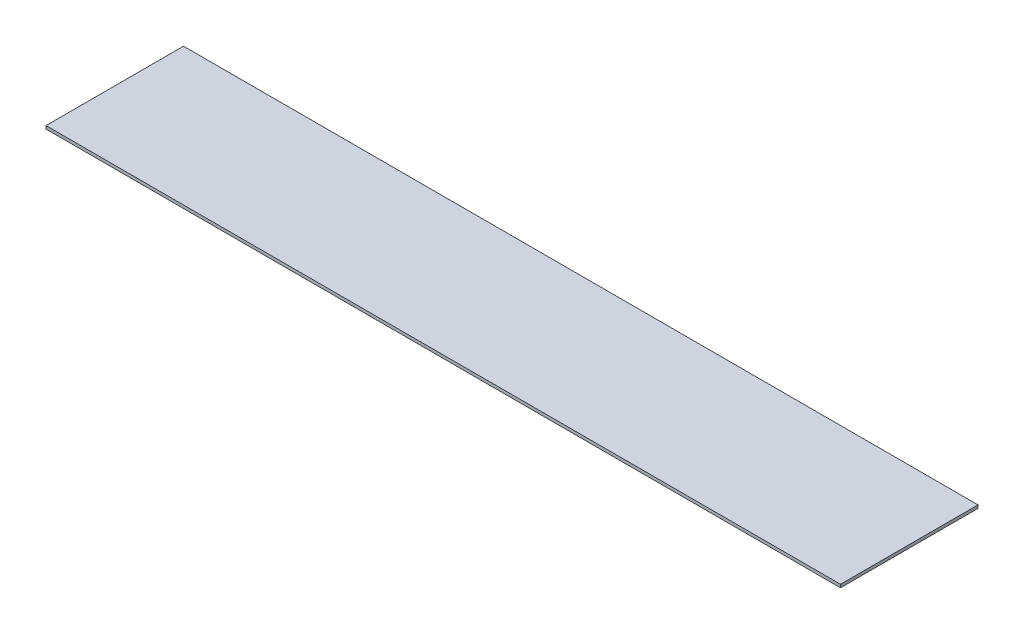
ISO-10303-21;
HEADER;
FILE_DESCRIPTION(('STEP AP214'),'2;1');
FILE_NAME('part.step','',(''),(''),'','','');
FILE_SCHEMA(('AUTOMOTIVE_DESIGN { 1 0 10303 214 1 1 1 1 }'));
ENDSEC;
DATA;
#1=APPLICATION_CONTEXT('core data for automotive mechanical design processes');
#2=APPLICATION_PROTOCOL_DEFINITION('international standard','automotive_design',2000,#1);
#3=PRODUCT_CONTEXT('',#1,'mechanical');
#4=PRODUCT('Part','Part','',(#3));
#5=PRODUCT_RELATED_PRODUCT_CATEGORY('part','',(#4));
#6=PRODUCT_DEFINITION_FORMATION('','',#4);
#7=PRODUCT_DEFINITION_CONTEXT('part definition',#1,'design');
#8=PRODUCT_DEFINITION('design','',#6,#7);
#9=PRODUCT_DEFINITION_SHAPE('','',#8);
#10=(LENGTH_UNIT() NAMED_UNIT(*) SI_UNIT(.MILLI.,.METRE.));
#11=(NAMED_UNIT(*) PLANE_ANGLE_UNIT() SI_UNIT($,.RADIAN.));
#12=(NAMED_UNIT(*) SI_UNIT($,.STERADIAN.) SOLID_ANGLE_UNIT());
#13=UNCERTAINTY_MEASURE_WITH_UNIT(LENGTH_MEASURE(1.E-05),#10,'distance_accuracy_value','');
#14=(GEOMETRIC_REPRESENTATION_CONTEXT(3) GLOBAL_UNCERTAINTY_ASSIGNED_CONTEXT((#13)) GLOBAL_UNIT_ASSIGNED_CONTEXT((#10,
#11,#12)) REPRESENTATION_CONTEXT('',''));
#15=CARTESIAN_POINT('',(0.,0.,0.));
#16=DIRECTION('',(0.,0.,1.));
#17=DIRECTION('',(1.,0.,0.));
#18=AXIS2_PLACEMENT_3D('',#15,#16,#17);
#19=CARTESIAN_POINT('',(-151.496062992126,1.,-99.7007874015748));
#20=DIRECTION('',(1.,0.,0.));
#21=DIRECTION('',(0.,0.,-1.));
#22=AXIS2_PLACEMENT_3D('',#19,#20,#21);
#23=PLANE('',#22);
#24=DIRECTION('',(0.,0.,1.));
#25=VECTOR('',#24,1.);
#26=CARTESIAN_POINT('',(-151.496062992126,0.,-99.7007874015748));
#27=LINE('',#26,#25);
#28=CARTESIAN_POINT('',(-151.496062992126,0.,-99.7007874015748));
#29=VERTEX_POINT('',#28);
#30=CARTESIAN_POINT('',(-151.496062992126,0.,-54.7007874015748));
#31=VERTEX_POINT('',#30);
#32=EDGE_CURVE('E97',#29,#31,#27,.T.);
#33=ORIENTED_EDGE('',*,*,#32,.T.);
#34=DIRECTION('',(0.,-1.,0.));
#35=VECTOR('',#34,1.);
#36=CARTESIAN_POINT('',(-151.496062992126,1.,-54.7007874015748));
#37=LINE('',#36,#35);
#38=CARTESIAN_POINT('',(-151.496062992126,1.,-54.7007874015748));
#39=VERTEX_POINT('',#38);
#40=EDGE_CURVE('E11',#39,#31,#37,.T.);
#41=ORIENTED_EDGE('',*,*,#40,.F.);
#42=DIRECTION('',(0.,0.,1.));
#43=VECTOR('',#42,1.);
#44=CARTESIAN_POINT('',(-151.496062992126,1.,-99.7007874015748));
#45=LINE('',#44,#43);
#46=CARTESIAN_POINT('',(-151.496062992126,1.,-99.7007874015748));
#47=VERTEX_POINT('',#46);
#48=EDGE_CURVE('E85',#47,#39,#45,.T.);
#49=ORIENTED_EDGE('',*,*,#48,.F.);
#50=DIRECTION('',(0.,-1.,0.));
#51=VECTOR('',#50,1.);
#52=CARTESIAN_POINT('',(-151.496062992126,1.,-99.7007874015748));
#53=LINE('',#52,#51);
#54=EDGE_CURVE('E93',#47,#29,#53,.T.);
#55=ORIENTED_EDGE('',*,*,#54,.T.);
#56=EDGE_LOOP('',(#33,#41,#49,#55));
#57=FACE_BOUND('',#56,.T.);
#58=ADVANCED_FACE('F34',(#57),#23,.F.);
#59=CARTESIAN_POINT('',(-151.496062992126,1.,-54.7007874015748));
#60=DIRECTION('',(0.,0.,-1.));
#61=DIRECTION('',(-1.,0.,0.));
#62=AXIS2_PLACEMENT_3D('',#59,#60,#61);
#63=PLANE('',#62);
#64=DIRECTION('',(1.,0.,0.));
#65=VECTOR('',#64,1.);
#66=CARTESIAN_POINT('',(-151.496062992126,0.,-54.7007874015748));
#67=LINE('',#66,#65);
#68=CARTESIAN_POINT('',(108.503937007874,0.,-54.7007874015748));
#69=VERTEX_POINT('',#68);
#70=EDGE_CURVE('E89',#31,#69,#67,.T.);
#71=ORIENTED_EDGE('',*,*,#70,.T.);
#72=DIRECTION('',(0.,-1.,0.));
#73=VECTOR('',#72,1.);
#74=CARTESIAN_POINT('',(108.503937007874,1.,-54.7007874015748));
#75=LINE('',#74,#73);
#76=CARTESIAN_POINT('',(108.503937007874,1.,-54.7007874015748));
#77=VERTEX_POINT('',#76);
#78=EDGE_CURVE('E42',#77,#69,#75,.T.);
#79=ORIENTED_EDGE('',*,*,#78,.F.);
#80=DIRECTION('',(1.,0.,0.));
#81=VECTOR('',#80,1.);
#82=CARTESIAN_POINT('',(-151.496062992126,1.,-54.7007874015748));
#83=LINE('',#82,#81);
#84=EDGE_CURVE('E80',#39,#77,#83,.T.);
#85=ORIENTED_EDGE('',*,*,#84,.F.);
#86=ORIENTED_EDGE('',*,*,#40,.T.);
#87=EDGE_LOOP('',(#71,#79,#85,#86));
#88=FACE_BOUND('',#87,.T.);
#89=ADVANCED_FACE('F88',(#88),#63,.F.);
#90=CARTESIAN_POINT('',(108.503937007874,1.,-99.7007874015748));
#91=DIRECTION('',(-1.,0.,0.));
#92=DIRECTION('',(0.,0.,1.));
#93=AXIS2_PLACEMENT_3D('',#90,#91,#92);
#94=PLANE('',#93);
#95=DIRECTION('',(0.,0.,-1.));
#96=VECTOR('',#95,1.);
#97=CARTESIAN_POINT('',(108.503937007874,0.,-99.7007874015748));
#98=LINE('',#97,#96);
#99=CARTESIAN_POINT('',(108.503937007874,0.,-99.7007874015748));
#100=VERTEX_POINT('',#99);
#101=EDGE_CURVE('E67',#69,#100,#98,.T.);
#102=ORIENTED_EDGE('',*,*,#101,.T.);
#103=DIRECTION('',(0.,-1.,0.));
#104=VECTOR('',#103,1.);
#105=CARTESIAN_POINT('',(108.503937007874,1.,-99.7007874015748));
#106=LINE('',#105,#104);
#107=CARTESIAN_POINT('',(108.503937007874,1.,-99.7007874015748));
#108=VERTEX_POINT('',#107);
#109=EDGE_CURVE('E90',#108,#100,#106,.T.);
#110=ORIENTED_EDGE('',*,*,#109,.F.);
#111=DIRECTION('',(0.,0.,-1.));
#112=VECTOR('',#111,1.);
#113=CARTESIAN_POINT('',(108.503937007874,1.,-99.7007874015748));
#114=LINE('',#113,#112);
#115=EDGE_CURVE('E83',#77,#108,#114,.T.);
#116=ORIENTED_EDGE('',*,*,#115,.F.);
#117=ORIENTED_EDGE('',*,*,#78,.T.);
#118=EDGE_LOOP('',(#102,#110,#116,#117));
#119=FACE_BOUND('',#118,.T.);
#120=ADVANCED_FACE('F91',(#119),#94,.F.);
#121=CARTESIAN_POINT('',(-151.496062992126,1.,-99.7007874015748));
#122=DIRECTION('',(0.,0.,1.));
#123=DIRECTION('',(1.,0.,0.));
#124=AXIS2_PLACEMENT_3D('',#121,#122,#123);
#125=PLANE('',#124);
#126=DIRECTION('',(-1.,0.,0.));
#127=VECTOR('',#126,1.);
#128=CARTESIAN_POINT('',(-151.496062992126,0.,-99.7007874015748));
#129=LINE('',#128,#127);
#130=EDGE_CURVE('E73',#100,#29,#129,.T.);
#131=ORIENTED_EDGE('',*,*,#130,.T.);
#132=ORIENTED_EDGE('',*,*,#54,.F.);
#133=DIRECTION('',(-1.,0.,0.));
#134=VECTOR('',#133,1.);
#135=CARTESIAN_POINT('',(-151.496062992126,1.,-99.7007874015748));
#136=LINE('',#135,#134);
#137=EDGE_CURVE('E50',#108,#47,#136,.T.);
#138=ORIENTED_EDGE('',*,*,#137,.F.);
#139=ORIENTED_EDGE('',*,*,#109,.T.);
#140=EDGE_LOOP('',(#131,#132,#138,#139));
#141=FACE_BOUND('',#140,.T.);
#142=ADVANCED_FACE('F104',(#141),#125,.F.);
#143=CARTESIAN_POINT('',(0.,1.,0.));
#144=DIRECTION('',(0.,1.,0.));
#145=DIRECTION('',(0.,0.,1.));
#146=AXIS2_PLACEMENT_3D('',#143,#144,#145);
#147=PLANE('',#146);
#148=ORIENTED_EDGE('',*,*,#48,.T.);
#149=ORIENTED_EDGE('',*,*,#84,.T.);
#150=ORIENTED_EDGE('',*,*,#115,.T.);
#151=ORIENTED_EDGE('',*,*,#137,.T.);
#152=EDGE_LOOP('',(#148,#149,#150,#151));
#153=FACE_BOUND('',#152,.T.);
#154=ADVANCED_FACE('F81',(#153),#147,.T.);
#155=CARTESIAN_POINT('',(0.,0.,0.));
#156=DIRECTION('',(0.,1.,0.));
#157=DIRECTION('',(0.,0.,1.));
#158=AXIS2_PLACEMENT_3D('',#155,#156,#157);
#159=PLANE('',#158);
#160=ORIENTED_EDGE('',*,*,#32,.F.);
#161=ORIENTED_EDGE('',*,*,#130,.F.);
#162=ORIENTED_EDGE('',*,*,#101,.F.);
#163=ORIENTED_EDGE('',*,*,#70,.F.);
#164=EDGE_LOOP('',(#160,#161,#162,#163));
#165=FACE_BOUND('',#164,.T.);
#166=ADVANCED_FACE('F107',(#165),#159,.F.);
#167=CLOSED_SHELL('',(#58,#89,#120,#142,#154,#166));
#168=MANIFOLD_SOLID_BREP('B2',#167);
#169=ADVANCED_BREP_SHAPE_REPRESENTATION('',(#18,#168),#14);
#170=SHAPE_DEFINITION_REPRESENTATION(#9,#169);
ENDSEC;
END-ISO-10303-21;
